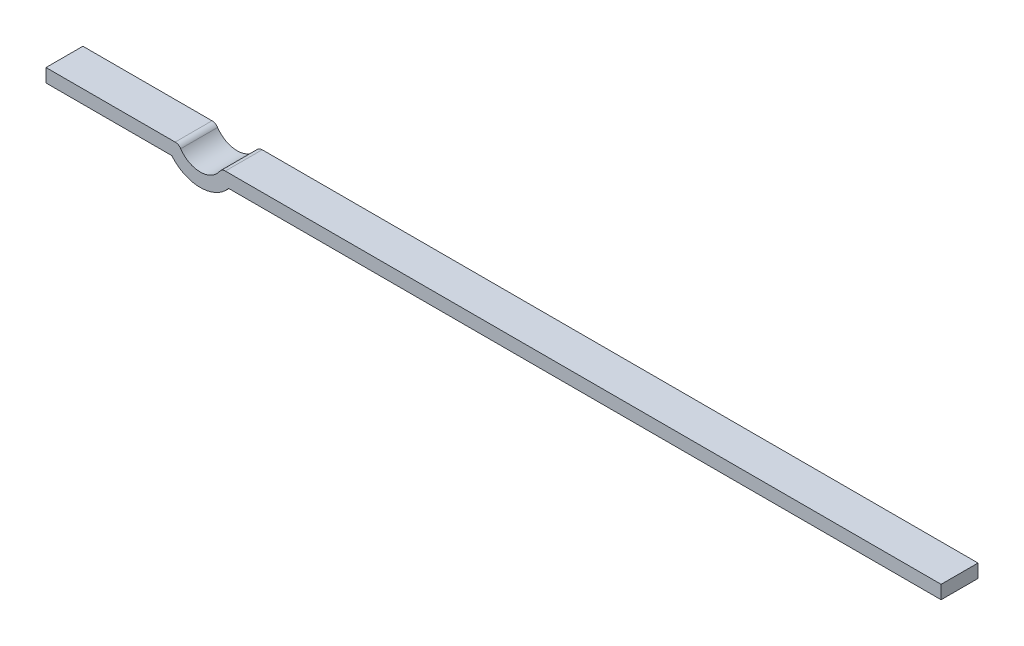
ISO-10303-21;
HEADER;
FILE_DESCRIPTION(('STEP AP214'),'2;1');
FILE_NAME('part.step','',(''),(''),'','','');
FILE_SCHEMA(('AUTOMOTIVE_DESIGN { 1 0 10303 214 1 1 1 1 }'));
ENDSEC;
DATA;
#1=APPLICATION_CONTEXT('core data for automotive mechanical design processes');
#2=APPLICATION_PROTOCOL_DEFINITION('international standard','automotive_design',2000,#1);
#3=PRODUCT_CONTEXT('',#1,'mechanical');
#4=PRODUCT('Part','Part','',(#3));
#5=PRODUCT_RELATED_PRODUCT_CATEGORY('part','',(#4));
#6=PRODUCT_DEFINITION_FORMATION('','',#4);
#7=PRODUCT_DEFINITION_CONTEXT('part definition',#1,'design');
#8=PRODUCT_DEFINITION('design','',#6,#7);
#9=PRODUCT_DEFINITION_SHAPE('','',#8);
#10=(LENGTH_UNIT() NAMED_UNIT(*) SI_UNIT(.MILLI.,.METRE.));
#11=(NAMED_UNIT(*) PLANE_ANGLE_UNIT() SI_UNIT($,.RADIAN.));
#12=(NAMED_UNIT(*) SI_UNIT($,.STERADIAN.) SOLID_ANGLE_UNIT());
#13=UNCERTAINTY_MEASURE_WITH_UNIT(LENGTH_MEASURE(1.E-05),#10,'distance_accuracy_value','');
#14=(GEOMETRIC_REPRESENTATION_CONTEXT(3) GLOBAL_UNCERTAINTY_ASSIGNED_CONTEXT((#13)) GLOBAL_UNIT_ASSIGNED_CONTEXT((#10,
#11,#12)) REPRESENTATION_CONTEXT('',''));
#15=CARTESIAN_POINT('',(0.,0.,0.));
#16=DIRECTION('',(0.,0.,1.));
#17=DIRECTION('',(1.,0.,0.));
#18=AXIS2_PLACEMENT_3D('',#15,#16,#17);
#19=CARTESIAN_POINT('',(-3.9505,-0.1,0.55));
#20=DIRECTION('',(0.,1.,0.));
#21=DIRECTION('',(0.,0.,1.));
#22=AXIS2_PLACEMENT_3D('',#19,#20,#21);
#23=PLANE('',#22);
#24=DIRECTION('',(0.,0.,1.));
#25=VECTOR('',#24,1.);
#26=CARTESIAN_POINT('',(6.675,-0.1,0.55));
#27=LINE('',#26,#25);
#28=CARTESIAN_POINT('',(6.675,-0.1,0.));
#29=VERTEX_POINT('',#28);
#30=CARTESIAN_POINT('',(6.675,-0.1,0.55));
#31=VERTEX_POINT('',#30);
#32=EDGE_CURVE('E135',#29,#31,#27,.T.);
#33=ORIENTED_EDGE('',*,*,#32,.T.);
#34=DIRECTION('',(-1.,0.,0.));
#35=VECTOR('',#34,1.);
#36=CARTESIAN_POINT('',(-4.00059565600384,-0.1,0.55));
#37=LINE('',#36,#35);
#38=CARTESIAN_POINT('',(-3.9505,-0.0999999999999999,0.55));
#39=VERTEX_POINT('',#38);
#40=EDGE_CURVE('E85',#31,#39,#37,.T.);
#41=ORIENTED_EDGE('',*,*,#40,.T.);
#42=DIRECTION('',(0.,0.,-1.));
#43=VECTOR('',#42,1.);
#44=CARTESIAN_POINT('',(-3.9505,-0.0999999999999998,0.55));
#45=LINE('',#44,#43);
#46=CARTESIAN_POINT('',(-3.9505,-0.0999999999999999,0.));
#47=VERTEX_POINT('',#46);
#48=EDGE_CURVE('E77',#47,#39,#45,.F.);
#49=ORIENTED_EDGE('',*,*,#48,.F.);
#50=DIRECTION('',(-1.,0.,0.));
#51=VECTOR('',#50,1.);
#52=CARTESIAN_POINT('',(-4.00059565600384,-0.1,0.));
#53=LINE('',#52,#51);
#54=EDGE_CURVE('E151',#29,#47,#53,.T.);
#55=ORIENTED_EDGE('',*,*,#54,.F.);
#56=EDGE_LOOP('',(#33,#41,#49,#55));
#57=FACE_BOUND('',#56,.T.);
#58=ADVANCED_FACE('F17',(#57),#23,.F.);
#59=CARTESIAN_POINT('',(-4.37475,0.250017053155985,0.55));
#60=DIRECTION('',(0.,0.,-1.));
#61=DIRECTION('',(-1.,0.,0.));
#62=AXIS2_PLACEMENT_3D('',#59,#60,#61);
#63=CYLINDRICAL_SURFACE('',#62,0.55);
#64=CARTESIAN_POINT('',(-4.37475,0.250017053155985,0.55));
#65=DIRECTION('',(0.,0.,-1.));
#66=DIRECTION('',(-1.,0.,0.));
#67=AXIS2_PLACEMENT_3D('',#64,#65,#66);
#68=CIRCLE('',#67,0.55);
#69=CARTESIAN_POINT('',(-4.799,-0.1,0.55));
#70=VERTEX_POINT('',#69);
#71=EDGE_CURVE('E20',#39,#70,#68,.T.);
#72=ORIENTED_EDGE('',*,*,#71,.T.);
#73=DIRECTION('',(0.,0.,1.));
#74=VECTOR('',#73,1.);
#75=CARTESIAN_POINT('',(-4.799,-0.1,0.55));
#76=LINE('',#75,#74);
#77=CARTESIAN_POINT('',(-4.799,-0.1,0.));
#78=VERTEX_POINT('',#77);
#79=EDGE_CURVE('E117',#70,#78,#76,.F.);
#80=ORIENTED_EDGE('',*,*,#79,.T.);
#81=CARTESIAN_POINT('',(-4.37475,0.250017053155985,0.));
#82=DIRECTION('',(0.,0.,-1.));
#83=DIRECTION('',(-1.,0.,0.));
#84=AXIS2_PLACEMENT_3D('',#81,#82,#83);
#85=CIRCLE('',#84,0.55);
#86=EDGE_CURVE('E103',#47,#78,#85,.T.);
#87=ORIENTED_EDGE('',*,*,#86,.F.);
#88=ORIENTED_EDGE('',*,*,#48,.T.);
#89=EDGE_LOOP('',(#72,#80,#87,#88));
#90=FACE_BOUND('',#89,.T.);
#91=ADVANCED_FACE('F291',(#90),#63,.T.);
#92=CARTESIAN_POINT('',(-6.675,-0.1,0.55));
#93=DIRECTION('',(0.,1.,0.));
#94=DIRECTION('',(0.,0.,1.));
#95=AXIS2_PLACEMENT_3D('',#92,#93,#94);
#96=PLANE('',#95);
#97=ORIENTED_EDGE('',*,*,#79,.F.);
#98=DIRECTION('',(-1.,0.,0.));
#99=VECTOR('',#98,1.);
#100=CARTESIAN_POINT('',(-4.00059565600384,-0.1,0.55));
#101=LINE('',#100,#99);
#102=CARTESIAN_POINT('',(-6.675,-0.1,0.55));
#103=VERTEX_POINT('',#102);
#104=EDGE_CURVE('E112',#70,#103,#101,.T.);
#105=ORIENTED_EDGE('',*,*,#104,.T.);
#106=DIRECTION('',(0.,0.,-1.));
#107=VECTOR('',#106,1.);
#108=CARTESIAN_POINT('',(-6.675,-0.1,0.55));
#109=LINE('',#108,#107);
#110=CARTESIAN_POINT('',(-6.675,-0.1,0.));
#111=VERTEX_POINT('',#110);
#112=EDGE_CURVE('E109',#103,#111,#109,.T.);
#113=ORIENTED_EDGE('',*,*,#112,.T.);
#114=DIRECTION('',(-1.,0.,0.));
#115=VECTOR('',#114,1.);
#116=CARTESIAN_POINT('',(-4.00059565600384,-0.1,0.));
#117=LINE('',#116,#115);
#118=EDGE_CURVE('E97',#78,#111,#117,.T.);
#119=ORIENTED_EDGE('',*,*,#118,.F.);
#120=EDGE_LOOP('',(#97,#105,#113,#119));
#121=FACE_BOUND('',#120,.T.);
#122=ADVANCED_FACE('F110',(#121),#96,.F.);
#123=CARTESIAN_POINT('',(-6.675,-0.1,0.55));
#124=DIRECTION('',(1.,0.,0.));
#125=DIRECTION('',(0.,0.,-1.));
#126=AXIS2_PLACEMENT_3D('',#123,#124,#125);
#127=PLANE('',#126);
#128=ORIENTED_EDGE('',*,*,#112,.F.);
#129=DIRECTION('',(0.,1.,0.));
#130=VECTOR('',#129,1.);
#131=CARTESIAN_POINT('',(-6.675,0.,0.55));
#132=LINE('',#131,#130);
#133=CARTESIAN_POINT('',(-6.675,0.1,0.55));
#134=VERTEX_POINT('',#133);
#135=EDGE_CURVE('E140',#103,#134,#132,.T.);
#136=ORIENTED_EDGE('',*,*,#135,.T.);
#137=DIRECTION('',(0.,0.,1.));
#138=VECTOR('',#137,1.);
#139=CARTESIAN_POINT('',(-6.675,0.1,0.55));
#140=LINE('',#139,#138);
#141=CARTESIAN_POINT('',(-6.675,0.1,0.));
#142=VERTEX_POINT('',#141);
#143=EDGE_CURVE('E116',#134,#142,#140,.F.);
#144=ORIENTED_EDGE('',*,*,#143,.T.);
#145=DIRECTION('',(0.,1.,0.));
#146=VECTOR('',#145,1.);
#147=CARTESIAN_POINT('',(-6.675,0.,0.));
#148=LINE('',#147,#146);
#149=EDGE_CURVE('E101',#111,#142,#148,.T.);
#150=ORIENTED_EDGE('',*,*,#149,.F.);
#151=EDGE_LOOP('',(#128,#136,#144,#150));
#152=FACE_BOUND('',#151,.T.);
#153=ADVANCED_FACE('F119',(#152),#127,.F.);
#154=CARTESIAN_POINT('',(-6.675,0.1,0.55));
#155=DIRECTION('',(0.,-1.,0.));
#156=DIRECTION('',(1.,0.,0.));
#157=AXIS2_PLACEMENT_3D('',#154,#155,#156);
#158=PLANE('',#157);
#159=ORIENTED_EDGE('',*,*,#143,.F.);
#160=DIRECTION('',(-1.,0.,0.));
#161=VECTOR('',#160,1.);
#162=CARTESIAN_POINT('',(-4.00059565600384,0.1,0.55));
#163=LINE('',#162,#161);
#164=CARTESIAN_POINT('',(-4.74890434399616,0.1,0.55));
#165=VERTEX_POINT('',#164);
#166=EDGE_CURVE('E142',#134,#165,#163,.F.);
#167=ORIENTED_EDGE('',*,*,#166,.T.);
#168=DIRECTION('',(0.,0.,-1.));
#169=VECTOR('',#168,1.);
#170=CARTESIAN_POINT('',(-4.74890434399616,0.1,0.55));
#171=LINE('',#170,#169);
#172=CARTESIAN_POINT('',(-4.74890434399616,0.1,0.));
#173=VERTEX_POINT('',#172);
#174=EDGE_CURVE('E187',#173,#165,#171,.F.);
#175=ORIENTED_EDGE('',*,*,#174,.F.);
#176=DIRECTION('',(-1.,0.,0.));
#177=VECTOR('',#176,1.);
#178=CARTESIAN_POINT('',(-4.00059565600384,0.1,0.));
#179=LINE('',#178,#177);
#180=EDGE_CURVE('E121',#142,#173,#179,.F.);
#181=ORIENTED_EDGE('',*,*,#180,.F.);
#182=EDGE_LOOP('',(#159,#167,#175,#181));
#183=FACE_BOUND('',#182,.T.);
#184=ADVANCED_FACE('F198',(#183),#158,.F.);
#185=CARTESIAN_POINT('',(-4.74890434399616,0.,0.55));
#186=DIRECTION('',(0.,0.,-1.));
#187=DIRECTION('',(-1.,0.,0.));
#188=AXIS2_PLACEMENT_3D('',#185,#186,#187);
#189=CYLINDRICAL_SURFACE('',#188,0.1);
#190=CARTESIAN_POINT('',(-4.74890434399616,0.,0.55));
#191=DIRECTION('',(0.,0.,-1.));
#192=DIRECTION('',(-1.,0.,0.));
#193=AXIS2_PLACEMENT_3D('',#190,#191,#192);
#194=CIRCLE('',#193,0.1);
#195=CARTESIAN_POINT('',(-4.66575893421924,0.0555593451457744,0.55));
#196=VERTEX_POINT('',#195);
#197=EDGE_CURVE('E159',#165,#196,#194,.T.);
#198=ORIENTED_EDGE('',*,*,#197,.T.);
#199=DIRECTION('',(0.,0.,-1.));
#200=VECTOR('',#199,1.);
#201=CARTESIAN_POINT('',(-4.66575893421924,0.0555593451457742,0.55));
#202=LINE('',#201,#200);
#203=CARTESIAN_POINT('',(-4.66575893421924,0.0555593451457745,0.));
#204=VERTEX_POINT('',#203);
#205=EDGE_CURVE('E137',#196,#204,#202,.T.);
#206=ORIENTED_EDGE('',*,*,#205,.T.);
#207=CARTESIAN_POINT('',(-4.74890434399616,0.,0.));
#208=DIRECTION('',(0.,0.,-1.));
#209=DIRECTION('',(-1.,0.,0.));
#210=AXIS2_PLACEMENT_3D('',#207,#208,#209);
#211=CIRCLE('',#210,0.1);
#212=EDGE_CURVE('E123',#173,#204,#211,.T.);
#213=ORIENTED_EDGE('',*,*,#212,.F.);
#214=ORIENTED_EDGE('',*,*,#174,.T.);
#215=EDGE_LOOP('',(#198,#206,#213,#214));
#216=FACE_BOUND('',#215,.T.);
#217=ADVANCED_FACE('F189',(#216),#189,.T.);
#218=CARTESIAN_POINT('',(-4.37475,0.250017053155985,0.55));
#219=DIRECTION('',(0.,0.,-1.));
#220=DIRECTION('',(-1.,0.,0.));
#221=AXIS2_PLACEMENT_3D('',#218,#219,#220);
#222=CYLINDRICAL_SURFACE('',#221,0.35);
#223=ORIENTED_EDGE('',*,*,#205,.F.);
#224=CARTESIAN_POINT('',(-4.37475,0.250017053155985,0.55));
#225=DIRECTION('',(0.,0.,-1.));
#226=DIRECTION('',(-1.,0.,0.));
#227=AXIS2_PLACEMENT_3D('',#224,#225,#226);
#228=CIRCLE('',#227,0.35);
#229=CARTESIAN_POINT('',(-4.08374106578076,0.0555593451457748,0.55));
#230=VERTEX_POINT('',#229);
#231=EDGE_CURVE('E156',#196,#230,#228,.F.);
#232=ORIENTED_EDGE('',*,*,#231,.T.);
#233=DIRECTION('',(0.,0.,-1.));
#234=VECTOR('',#233,1.);
#235=CARTESIAN_POINT('',(-4.08374106578076,0.0555593451457746,0.55));
#236=LINE('',#235,#234);
#237=CARTESIAN_POINT('',(-4.08374106578076,0.0555593451457748,0.));
#238=VERTEX_POINT('',#237);
#239=EDGE_CURVE('E155',#238,#230,#236,.F.);
#240=ORIENTED_EDGE('',*,*,#239,.F.);
#241=CARTESIAN_POINT('',(-4.37475,0.250017053155985,0.));
#242=DIRECTION('',(0.,0.,-1.));
#243=DIRECTION('',(-1.,0.,0.));
#244=AXIS2_PLACEMENT_3D('',#241,#242,#243);
#245=CIRCLE('',#244,0.35);
#246=EDGE_CURVE('E147',#204,#238,#245,.F.);
#247=ORIENTED_EDGE('',*,*,#246,.F.);
#248=EDGE_LOOP('',(#223,#232,#240,#247));
#249=FACE_BOUND('',#248,.T.);
#250=ADVANCED_FACE('F196',(#249),#222,.F.);
#251=CARTESIAN_POINT('',(6.675,-0.1,0.55));
#252=DIRECTION('',(-1.,0.,0.));
#253=DIRECTION('',(0.,0.,1.));
#254=AXIS2_PLACEMENT_3D('',#251,#252,#253);
#255=PLANE('',#254);
#256=DIRECTION('',(0.,0.,1.));
#257=VECTOR('',#256,1.);
#258=CARTESIAN_POINT('',(6.675,0.1,0.55));
#259=LINE('',#258,#257);
#260=CARTESIAN_POINT('',(6.675,0.1,0.));
#261=VERTEX_POINT('',#260);
#262=CARTESIAN_POINT('',(6.675,0.1,0.55));
#263=VERTEX_POINT('',#262);
#264=EDGE_CURVE('E146',#261,#263,#259,.T.);
#265=ORIENTED_EDGE('',*,*,#264,.T.);
#266=DIRECTION('',(0.,1.,0.));
#267=VECTOR('',#266,1.);
#268=CARTESIAN_POINT('',(6.675,0.,0.55));
#269=LINE('',#268,#267);
#270=EDGE_CURVE('E158',#263,#31,#269,.F.);
#271=ORIENTED_EDGE('',*,*,#270,.T.);
#272=ORIENTED_EDGE('',*,*,#32,.F.);
#273=DIRECTION('',(0.,1.,0.));
#274=VECTOR('',#273,1.);
#275=CARTESIAN_POINT('',(6.675,0.,0.));
#276=LINE('',#275,#274);
#277=EDGE_CURVE('E154',#261,#29,#276,.F.);
#278=ORIENTED_EDGE('',*,*,#277,.F.);
#279=EDGE_LOOP('',(#265,#271,#272,#278));
#280=FACE_BOUND('',#279,.T.);
#281=ADVANCED_FACE('F224',(#280),#255,.F.);
#282=CARTESIAN_POINT('',(-4.00059565600384,0.,0.55));
#283=DIRECTION('',(0.,0.,-1.));
#284=DIRECTION('',(-1.,0.,0.));
#285=AXIS2_PLACEMENT_3D('',#282,#283,#284);
#286=PLANE('',#285);
#287=DIRECTION('',(1.,0.,0.));
#288=VECTOR('',#287,1.);
#289=CARTESIAN_POINT('',(-4.00059565600384,0.1,0.55));
#290=LINE('',#289,#288);
#291=CARTESIAN_POINT('',(-4.00059565600384,0.1,0.55));
#292=VERTEX_POINT('',#291);
#293=EDGE_CURVE('E316',#263,#292,#290,.F.);
#294=ORIENTED_EDGE('',*,*,#293,.T.);
#295=CARTESIAN_POINT('',(-4.00059565600384,0.,0.55));
#296=DIRECTION('',(0.,0.,-1.));
#297=DIRECTION('',(-1.,0.,0.));
#298=AXIS2_PLACEMENT_3D('',#295,#296,#297);
#299=CIRCLE('',#298,0.1);
#300=EDGE_CURVE('E152',#230,#292,#299,.T.);
#301=ORIENTED_EDGE('',*,*,#300,.F.);
#302=ORIENTED_EDGE('',*,*,#231,.F.);
#303=ORIENTED_EDGE('',*,*,#197,.F.);
#304=ORIENTED_EDGE('',*,*,#166,.F.);
#305=ORIENTED_EDGE('',*,*,#135,.F.);
#306=ORIENTED_EDGE('',*,*,#104,.F.);
#307=ORIENTED_EDGE('',*,*,#71,.F.);
#308=ORIENTED_EDGE('',*,*,#40,.F.);
#309=ORIENTED_EDGE('',*,*,#270,.F.);
#310=EDGE_LOOP('',(#294,#301,#302,#303,#304,#305,#306,#307,#308,#309));
#311=FACE_BOUND('',#310,.T.);
#312=ADVANCED_FACE('F192',(#311),#286,.F.);
#313=CARTESIAN_POINT('',(-4.00059565600384,0.,0.55));
#314=DIRECTION('',(0.,0.,-1.));
#315=DIRECTION('',(-1.,0.,0.));
#316=AXIS2_PLACEMENT_3D('',#313,#314,#315);
#317=CYLINDRICAL_SURFACE('',#316,0.1);
#318=ORIENTED_EDGE('',*,*,#300,.T.);
#319=DIRECTION('',(0.,0.,1.));
#320=VECTOR('',#319,1.);
#321=CARTESIAN_POINT('',(-4.00059565600384,0.1,0.55));
#322=LINE('',#321,#320);
#323=CARTESIAN_POINT('',(-4.00059565600384,0.1,0.));
#324=VERTEX_POINT('',#323);
#325=EDGE_CURVE('E26',#292,#324,#322,.F.);
#326=ORIENTED_EDGE('',*,*,#325,.T.);
#327=CARTESIAN_POINT('',(-4.00059565600384,0.,0.));
#328=DIRECTION('',(0.,0.,-1.));
#329=DIRECTION('',(-1.,0.,0.));
#330=AXIS2_PLACEMENT_3D('',#327,#328,#329);
#331=CIRCLE('',#330,0.1);
#332=EDGE_CURVE('E34',#238,#324,#331,.T.);
#333=ORIENTED_EDGE('',*,*,#332,.F.);
#334=ORIENTED_EDGE('',*,*,#239,.T.);
#335=EDGE_LOOP('',(#318,#326,#333,#334));
#336=FACE_BOUND('',#335,.T.);
#337=ADVANCED_FACE('F215',(#336),#317,.T.);
#338=CARTESIAN_POINT('',(-4.00059565600384,0.,0.));
#339=DIRECTION('',(0.,0.,-1.));
#340=DIRECTION('',(-1.,0.,0.));
#341=AXIS2_PLACEMENT_3D('',#338,#339,#340);
#342=PLANE('',#341);
#343=ORIENTED_EDGE('',*,*,#332,.T.);
#344=DIRECTION('',(1.,0.,0.));
#345=VECTOR('',#344,1.);
#346=CARTESIAN_POINT('',(-4.00059565600384,0.1,0.));
#347=LINE('',#346,#345);
#348=EDGE_CURVE('E11',#324,#261,#347,.T.);
#349=ORIENTED_EDGE('',*,*,#348,.T.);
#350=ORIENTED_EDGE('',*,*,#277,.T.);
#351=ORIENTED_EDGE('',*,*,#54,.T.);
#352=ORIENTED_EDGE('',*,*,#86,.T.);
#353=ORIENTED_EDGE('',*,*,#118,.T.);
#354=ORIENTED_EDGE('',*,*,#149,.T.);
#355=ORIENTED_EDGE('',*,*,#180,.T.);
#356=ORIENTED_EDGE('',*,*,#212,.T.);
#357=ORIENTED_EDGE('',*,*,#246,.T.);
#358=EDGE_LOOP('',(#343,#349,#350,#351,#352,#353,#354,#355,#356,#357));
#359=FACE_BOUND('',#358,.T.);
#360=ADVANCED_FACE('F99',(#359),#342,.T.);
#361=CARTESIAN_POINT('',(-4.00059565600384,0.1,0.55));
#362=DIRECTION('',(0.,-1.,0.));
#363=DIRECTION('',(1.,0.,0.));
#364=AXIS2_PLACEMENT_3D('',#361,#362,#363);
#365=PLANE('',#364);
#366=ORIENTED_EDGE('',*,*,#325,.F.);
#367=ORIENTED_EDGE('',*,*,#293,.F.);
#368=ORIENTED_EDGE('',*,*,#264,.F.);
#369=ORIENTED_EDGE('',*,*,#348,.F.);
#370=EDGE_LOOP('',(#366,#367,#368,#369));
#371=FACE_BOUND('',#370,.T.);
#372=ADVANCED_FACE('F208',(#371),#365,.F.);
#373=CLOSED_SHELL('',(#58,#91,#122,#153,#184,#217,#250,#281,#312,#337,#360,#372));
#374=MANIFOLD_SOLID_BREP('B1',#373);
#375=ADVANCED_BREP_SHAPE_REPRESENTATION('',(#18,#374),#14);
#376=SHAPE_DEFINITION_REPRESENTATION(#9,#375);
ENDSEC;
END-ISO-10303-21;
